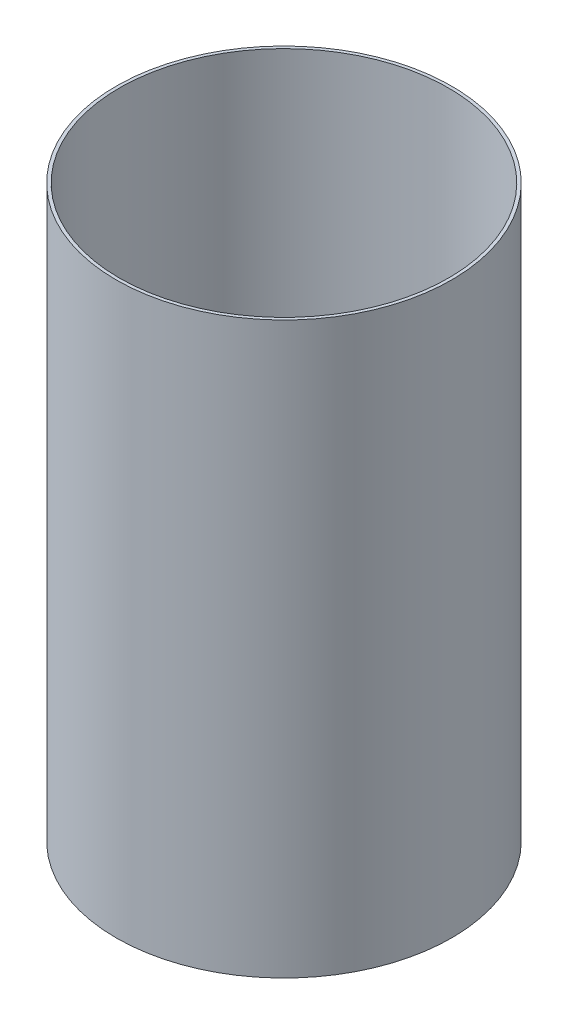
ISO-10303-21;
HEADER;
FILE_DESCRIPTION(('STEP AP214'),'2;1');
FILE_NAME('part.step','',(''),(''),'','','');
FILE_SCHEMA(('AUTOMOTIVE_DESIGN { 1 0 10303 214 1 1 1 1 }'));
ENDSEC;
DATA;
#1=APPLICATION_CONTEXT('core data for automotive mechanical design processes');
#2=APPLICATION_PROTOCOL_DEFINITION('international standard','automotive_design',2000,#1);
#3=PRODUCT_CONTEXT('',#1,'mechanical');
#4=PRODUCT('Part','Part','',(#3));
#5=PRODUCT_RELATED_PRODUCT_CATEGORY('part','',(#4));
#6=PRODUCT_DEFINITION_FORMATION('','',#4);
#7=PRODUCT_DEFINITION_CONTEXT('part definition',#1,'design');
#8=PRODUCT_DEFINITION('design','',#6,#7);
#9=PRODUCT_DEFINITION_SHAPE('','',#8);
#10=(LENGTH_UNIT() NAMED_UNIT(*) SI_UNIT(.MILLI.,.METRE.));
#11=(NAMED_UNIT(*) PLANE_ANGLE_UNIT() SI_UNIT($,.RADIAN.));
#12=(NAMED_UNIT(*) SI_UNIT($,.STERADIAN.) SOLID_ANGLE_UNIT());
#13=UNCERTAINTY_MEASURE_WITH_UNIT(LENGTH_MEASURE(1.E-05),#10,'distance_accuracy_value','');
#14=(GEOMETRIC_REPRESENTATION_CONTEXT(3) GLOBAL_UNCERTAINTY_ASSIGNED_CONTEXT((#13)) GLOBAL_UNIT_ASSIGNED_CONTEXT((#10,
#11,#12)) REPRESENTATION_CONTEXT('',''));
#15=CARTESIAN_POINT('',(0.,0.,0.));
#16=DIRECTION('',(0.,0.,1.));
#17=DIRECTION('',(1.,0.,0.));
#18=AXIS2_PLACEMENT_3D('',#15,#16,#17);
#19=CARTESIAN_POINT('',(0.,114.3,0.));
#20=DIRECTION('',(0.,1.,0.));
#21=DIRECTION('',(0.,0.,1.));
#22=AXIS2_PLACEMENT_3D('',#19,#20,#21);
#23=PLANE('',#22);
#24=CARTESIAN_POINT('',(0.,114.3,0.));
#25=DIRECTION('',(0.,1.,0.));
#26=DIRECTION('',(0.,0.,1.));
#27=AXIS2_PLACEMENT_3D('',#24,#25,#26);
#28=CIRCLE('',#27,67.31);
#29=CARTESIAN_POINT('',(0.,114.3,67.31));
#30=VERTEX_POINT('',#29);
#31=EDGE_CURVE('E12',#30,#30,#28,.T.);
#32=ORIENTED_EDGE('',*,*,#31,.T.);
#33=EDGE_LOOP('',(#32));
#34=FACE_BOUND('',#33,.T.);
#35=CARTESIAN_POINT('',(0.,114.3,0.));
#36=DIRECTION('',(0.,1.,0.));
#37=DIRECTION('',(0.,0.,1.));
#38=AXIS2_PLACEMENT_3D('',#35,#36,#37);
#39=CIRCLE('',#38,66.04);
#40=CARTESIAN_POINT('',(0.,114.3,66.04));
#41=VERTEX_POINT('',#40);
#42=EDGE_CURVE('E51',#41,#41,#39,.T.);
#43=ORIENTED_EDGE('',*,*,#42,.F.);
#44=EDGE_LOOP('',(#43));
#45=FACE_BOUND('',#44,.T.);
#46=ADVANCED_FACE('F40',(#34,#45),#23,.T.);
#47=CARTESIAN_POINT('',(0.,-114.3,0.));
#48=DIRECTION('',(0.,1.,0.));
#49=DIRECTION('',(0.,0.,1.));
#50=AXIS2_PLACEMENT_3D('',#47,#48,#49);
#51=PLANE('',#50);
#52=CARTESIAN_POINT('',(0.,-114.3,0.));
#53=DIRECTION('',(0.,1.,0.));
#54=DIRECTION('',(0.,0.,1.));
#55=AXIS2_PLACEMENT_3D('',#52,#53,#54);
#56=CIRCLE('',#55,67.31);
#57=CARTESIAN_POINT('',(0.,-114.3,67.31));
#58=VERTEX_POINT('',#57);
#59=EDGE_CURVE('E44',#58,#58,#56,.T.);
#60=ORIENTED_EDGE('',*,*,#59,.F.);
#61=EDGE_LOOP('',(#60));
#62=FACE_BOUND('',#61,.T.);
#63=CARTESIAN_POINT('',(0.,-114.3,0.));
#64=DIRECTION('',(0.,1.,0.));
#65=DIRECTION('',(0.,0.,1.));
#66=AXIS2_PLACEMENT_3D('',#63,#64,#65);
#67=CIRCLE('',#66,66.04);
#68=CARTESIAN_POINT('',(0.,-114.3,66.04));
#69=VERTEX_POINT('',#68);
#70=EDGE_CURVE('E53',#69,#69,#67,.T.);
#71=ORIENTED_EDGE('',*,*,#70,.T.);
#72=EDGE_LOOP('',(#71));
#73=FACE_BOUND('',#72,.T.);
#74=ADVANCED_FACE('F63',(#62,#73),#51,.F.);
#75=CARTESIAN_POINT('',(0.,114.3,0.));
#76=DIRECTION('',(0.,-1.,0.));
#77=DIRECTION('',(0.,0.,-1.));
#78=AXIS2_PLACEMENT_3D('',#75,#76,#77);
#79=CYLINDRICAL_SURFACE('',#78,67.31);
#80=ORIENTED_EDGE('',*,*,#31,.F.);
#81=EDGE_LOOP('',(#80));
#82=FACE_BOUND('',#81,.T.);
#83=ORIENTED_EDGE('',*,*,#59,.T.);
#84=EDGE_LOOP('',(#83));
#85=FACE_BOUND('',#84,.T.);
#86=ADVANCED_FACE('F42',(#82,#85),#79,.T.);
#87=CARTESIAN_POINT('',(0.,114.3,0.));
#88=DIRECTION('',(0.,-1.,0.));
#89=DIRECTION('',(0.,0.,-1.));
#90=AXIS2_PLACEMENT_3D('',#87,#88,#89);
#91=CYLINDRICAL_SURFACE('',#90,66.04);
#92=ORIENTED_EDGE('',*,*,#42,.T.);
#93=EDGE_LOOP('',(#92));
#94=FACE_BOUND('',#93,.T.);
#95=ORIENTED_EDGE('',*,*,#70,.F.);
#96=EDGE_LOOP('',(#95));
#97=FACE_BOUND('',#96,.T.);
#98=ADVANCED_FACE('F59',(#94,#97),#91,.F.);
#99=CLOSED_SHELL('',(#46,#74,#86,#98));
#100=MANIFOLD_SOLID_BREP('B2',#99);
#101=ADVANCED_BREP_SHAPE_REPRESENTATION('',(#18,#100),#14);
#102=SHAPE_DEFINITION_REPRESENTATION(#9,#101);
ENDSEC;
END-ISO-10303-21;
